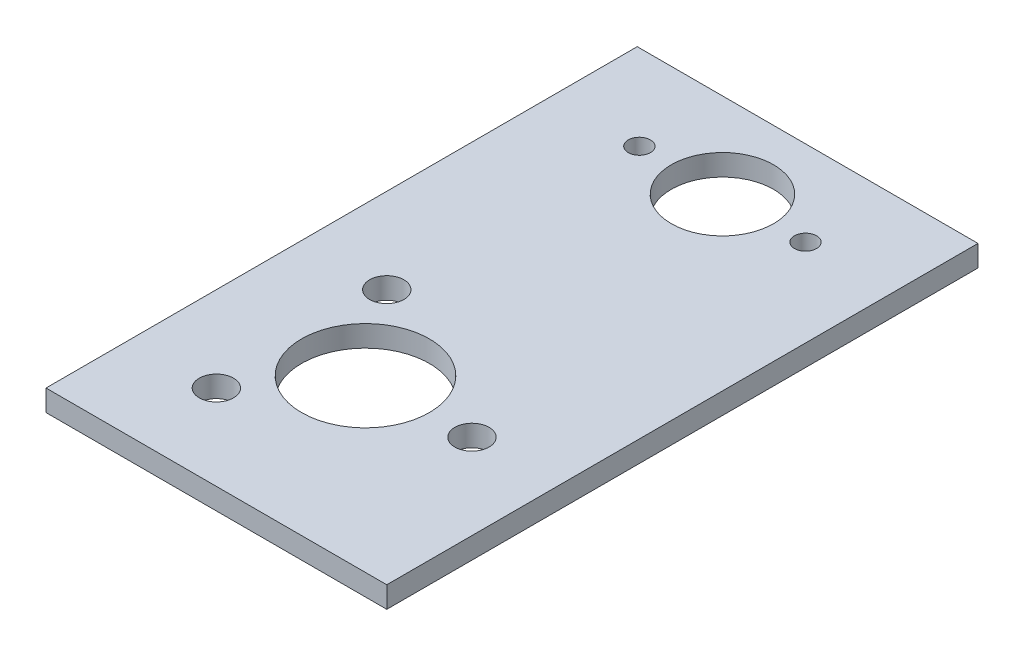
ISO-10303-21;
HEADER;
FILE_DESCRIPTION(('STEP AP214'),'2;1');
FILE_NAME('part.step','',(''),(''),'','','');
FILE_SCHEMA(('AUTOMOTIVE_DESIGN { 1 0 10303 214 1 1 1 1 }'));
ENDSEC;
DATA;
#1=APPLICATION_CONTEXT('core data for automotive mechanical design processes');
#2=APPLICATION_PROTOCOL_DEFINITION('international standard','automotive_design',2000,#1);
#3=PRODUCT_CONTEXT('',#1,'mechanical');
#4=PRODUCT('Part','Part','',(#3));
#5=PRODUCT_RELATED_PRODUCT_CATEGORY('part','',(#4));
#6=PRODUCT_DEFINITION_FORMATION('','',#4);
#7=PRODUCT_DEFINITION_CONTEXT('part definition',#1,'design');
#8=PRODUCT_DEFINITION('design','',#6,#7);
#9=PRODUCT_DEFINITION_SHAPE('','',#8);
#10=(LENGTH_UNIT() NAMED_UNIT(*) SI_UNIT(.MILLI.,.METRE.));
#11=(NAMED_UNIT(*) PLANE_ANGLE_UNIT() SI_UNIT($,.RADIAN.));
#12=(NAMED_UNIT(*) SI_UNIT($,.STERADIAN.) SOLID_ANGLE_UNIT());
#13=UNCERTAINTY_MEASURE_WITH_UNIT(LENGTH_MEASURE(1.E-05),#10,'distance_accuracy_value','');
#14=(GEOMETRIC_REPRESENTATION_CONTEXT(3) GLOBAL_UNCERTAINTY_ASSIGNED_CONTEXT((#13)) GLOBAL_UNIT_ASSIGNED_CONTEXT((#10,
#11,#12)) REPRESENTATION_CONTEXT('',''));
#15=CARTESIAN_POINT('',(0.,0.,0.));
#16=DIRECTION('',(0.,0.,1.));
#17=DIRECTION('',(1.,0.,0.));
#18=AXIS2_PLACEMENT_3D('',#15,#16,#17);
#19=CARTESIAN_POINT('',(0.,3.175,0.));
#20=DIRECTION('',(0.,0.,-1.));
#21=DIRECTION('',(-1.,0.,0.));
#22=AXIS2_PLACEMENT_3D('',#19,#20,#21);
#23=PLANE('',#22);
#24=DIRECTION('',(1.,0.,0.));
#25=VECTOR('',#24,1.);
#26=CARTESIAN_POINT('',(0.,0.,0.));
#27=LINE('',#26,#25);
#28=CARTESIAN_POINT('',(0.,0.,0.));
#29=VERTEX_POINT('',#28);
#30=CARTESIAN_POINT('',(50.8,0.,0.));
#31=VERTEX_POINT('',#30);
#32=EDGE_CURVE('E96',#29,#31,#27,.T.);
#33=ORIENTED_EDGE('',*,*,#32,.T.);
#34=DIRECTION('',(0.,-1.,0.));
#35=VECTOR('',#34,1.);
#36=CARTESIAN_POINT('',(50.8,3.175,0.));
#37=LINE('',#36,#35);
#38=CARTESIAN_POINT('',(50.8,3.175,0.));
#39=VERTEX_POINT('',#38);
#40=EDGE_CURVE('E11',#39,#31,#37,.T.);
#41=ORIENTED_EDGE('',*,*,#40,.F.);
#42=DIRECTION('',(1.,0.,0.));
#43=VECTOR('',#42,1.);
#44=CARTESIAN_POINT('',(0.,3.175,0.));
#45=LINE('',#44,#43);
#46=CARTESIAN_POINT('',(0.,3.175,0.));
#47=VERTEX_POINT('',#46);
#48=EDGE_CURVE('E82',#47,#39,#45,.T.);
#49=ORIENTED_EDGE('',*,*,#48,.F.);
#50=DIRECTION('',(0.,-1.,0.));
#51=VECTOR('',#50,1.);
#52=CARTESIAN_POINT('',(0.,3.175,0.));
#53=LINE('',#52,#51);
#54=EDGE_CURVE('E49',#47,#29,#53,.T.);
#55=ORIENTED_EDGE('',*,*,#54,.T.);
#56=EDGE_LOOP('',(#33,#41,#49,#55));
#57=FACE_BOUND('',#56,.T.);
#58=ADVANCED_FACE('F33',(#57),#23,.F.);
#59=CARTESIAN_POINT('',(50.8,3.175,0.));
#60=DIRECTION('',(-1.,0.,0.));
#61=DIRECTION('',(0.,0.,1.));
#62=AXIS2_PLACEMENT_3D('',#59,#60,#61);
#63=PLANE('',#62);
#64=DIRECTION('',(0.,0.,-1.));
#65=VECTOR('',#64,1.);
#66=CARTESIAN_POINT('',(50.8,0.,0.));
#67=LINE('',#66,#65);
#68=CARTESIAN_POINT('',(50.8,0.,-88.138));
#69=VERTEX_POINT('',#68);
#70=EDGE_CURVE('E87',#31,#69,#67,.T.);
#71=ORIENTED_EDGE('',*,*,#70,.T.);
#72=DIRECTION('',(0.,-1.,0.));
#73=VECTOR('',#72,1.);
#74=CARTESIAN_POINT('',(50.8,3.175,-88.138));
#75=LINE('',#74,#73);
#76=CARTESIAN_POINT('',(50.8,3.175,-88.138));
#77=VERTEX_POINT('',#76);
#78=EDGE_CURVE('E41',#77,#69,#75,.T.);
#79=ORIENTED_EDGE('',*,*,#78,.F.);
#80=DIRECTION('',(0.,0.,-1.));
#81=VECTOR('',#80,1.);
#82=CARTESIAN_POINT('',(50.8,3.175,0.));
#83=LINE('',#82,#81);
#84=EDGE_CURVE('E74',#39,#77,#83,.T.);
#85=ORIENTED_EDGE('',*,*,#84,.F.);
#86=ORIENTED_EDGE('',*,*,#40,.T.);
#87=EDGE_LOOP('',(#71,#79,#85,#86));
#88=FACE_BOUND('',#87,.T.);
#89=ADVANCED_FACE('F86',(#88),#63,.F.);
#90=CARTESIAN_POINT('',(0.,3.175,-88.138));
#91=DIRECTION('',(0.,0.,-1.));
#92=DIRECTION('',(-1.,0.,0.));
#93=AXIS2_PLACEMENT_3D('',#90,#91,#92);
#94=PLANE('',#93);
#95=DIRECTION('',(1.,0.,0.));
#96=VECTOR('',#95,1.);
#97=CARTESIAN_POINT('',(0.,0.,-88.138));
#98=LINE('',#97,#96);
#99=CARTESIAN_POINT('',(0.,0.,-88.138));
#100=VERTEX_POINT('',#99);
#101=EDGE_CURVE('E100',#100,#69,#98,.T.);
#102=ORIENTED_EDGE('',*,*,#101,.F.);
#103=DIRECTION('',(0.,-1.,0.));
#104=VECTOR('',#103,1.);
#105=CARTESIAN_POINT('',(0.,3.175,-88.138));
#106=LINE('',#105,#104);
#107=CARTESIAN_POINT('',(0.,3.175,-88.138));
#108=VERTEX_POINT('',#107);
#109=EDGE_CURVE('E63',#108,#100,#106,.T.);
#110=ORIENTED_EDGE('',*,*,#109,.F.);
#111=DIRECTION('',(1.,0.,0.));
#112=VECTOR('',#111,1.);
#113=CARTESIAN_POINT('',(0.,3.175,-88.138));
#114=LINE('',#113,#112);
#115=EDGE_CURVE('E81',#108,#77,#114,.T.);
#116=ORIENTED_EDGE('',*,*,#115,.T.);
#117=ORIENTED_EDGE('',*,*,#78,.T.);
#118=EDGE_LOOP('',(#102,#110,#116,#117));
#119=FACE_BOUND('',#118,.T.);
#120=ADVANCED_FACE('F90',(#119),#94,.T.);
#121=CARTESIAN_POINT('',(0.,3.175,0.));
#122=DIRECTION('',(-1.,0.,0.));
#123=DIRECTION('',(0.,0.,1.));
#124=AXIS2_PLACEMENT_3D('',#121,#122,#123);
#125=PLANE('',#124);
#126=DIRECTION('',(0.,0.,-1.));
#127=VECTOR('',#126,1.);
#128=CARTESIAN_POINT('',(0.,0.,0.));
#129=LINE('',#128,#127);
#130=EDGE_CURVE('E102',#29,#100,#129,.T.);
#131=ORIENTED_EDGE('',*,*,#130,.F.);
#132=ORIENTED_EDGE('',*,*,#54,.F.);
#133=DIRECTION('',(0.,0.,-1.));
#134=VECTOR('',#133,1.);
#135=CARTESIAN_POINT('',(0.,3.175,0.));
#136=LINE('',#135,#134);
#137=EDGE_CURVE('E91',#47,#108,#136,.T.);
#138=ORIENTED_EDGE('',*,*,#137,.T.);
#139=ORIENTED_EDGE('',*,*,#109,.T.);
#140=EDGE_LOOP('',(#131,#132,#138,#139));
#141=FACE_BOUND('',#140,.T.);
#142=ADVANCED_FACE('F162',(#141),#125,.T.);
#143=CARTESIAN_POINT('',(0.,3.175,0.));
#144=DIRECTION('',(0.,1.,0.));
#145=DIRECTION('',(0.,0.,1.));
#146=AXIS2_PLACEMENT_3D('',#143,#144,#145);
#147=PLANE('',#146);
#148=CARTESIAN_POINT('',(25.4,3.175,-75.438));
#149=DIRECTION('',(0.,1.,0.));
#150=DIRECTION('',(0.,0.,1.));
#151=AXIS2_PLACEMENT_3D('',#148,#149,#150);
#152=CIRCLE('',#151,7.61999999999998);
#153=CARTESIAN_POINT('',(25.4,3.175,-67.818));
#154=VERTEX_POINT('',#153);
#155=EDGE_CURVE('E144',#154,#154,#152,.T.);
#156=ORIENTED_EDGE('',*,*,#155,.F.);
#157=EDGE_LOOP('',(#156));
#158=FACE_BOUND('',#157,.T.);
#159=CARTESIAN_POINT('',(37.7825,3.175,-75.438));
#160=DIRECTION('',(0.,1.,0.));
#161=DIRECTION('',(0.,0.,1.));
#162=AXIS2_PLACEMENT_3D('',#159,#160,#161);
#163=CIRCLE('',#162,1.651);
#164=CARTESIAN_POINT('',(37.7825,3.175,-73.787));
#165=VERTEX_POINT('',#164);
#166=EDGE_CURVE('E138',#165,#165,#163,.T.);
#167=ORIENTED_EDGE('',*,*,#166,.F.);
#168=EDGE_LOOP('',(#167));
#169=FACE_BOUND('',#168,.T.);
#170=CARTESIAN_POINT('',(13.0175,3.175,-75.438));
#171=DIRECTION('',(0.,1.,0.));
#172=DIRECTION('',(0.,0.,1.));
#173=AXIS2_PLACEMENT_3D('',#170,#171,#172);
#174=CIRCLE('',#173,1.65099999999999);
#175=CARTESIAN_POINT('',(13.0175,3.175,-73.787));
#176=VERTEX_POINT('',#175);
#177=EDGE_CURVE('E132',#176,#176,#174,.T.);
#178=ORIENTED_EDGE('',*,*,#177,.F.);
#179=EDGE_LOOP('',(#178));
#180=FACE_BOUND('',#179,.T.);
#181=CARTESIAN_POINT('',(22.225,3.175,-25.4));
#182=DIRECTION('',(0.,1.,0.));
#183=DIRECTION('',(0.,0.,1.));
#184=AXIS2_PLACEMENT_3D('',#181,#182,#183);
#185=CIRCLE('',#184,9.52500000000001);
#186=CARTESIAN_POINT('',(22.225,3.175,-15.875));
#187=VERTEX_POINT('',#186);
#188=EDGE_CURVE('E126',#187,#187,#185,.T.);
#189=ORIENTED_EDGE('',*,*,#188,.F.);
#190=EDGE_LOOP('',(#189));
#191=FACE_BOUND('',#190,.T.);
#192=CARTESIAN_POINT('',(38.1,3.175,-25.4));
#193=DIRECTION('',(0.,1.,0.));
#194=DIRECTION('',(0.,0.,1.));
#195=AXIS2_PLACEMENT_3D('',#192,#193,#194);
#196=CIRCLE('',#195,2.5527);
#197=CARTESIAN_POINT('',(38.1,3.175,-22.8473));
#198=VERTEX_POINT('',#197);
#199=EDGE_CURVE('E120',#198,#198,#196,.T.);
#200=ORIENTED_EDGE('',*,*,#199,.F.);
#201=EDGE_LOOP('',(#200));
#202=FACE_BOUND('',#201,.T.);
#203=CARTESIAN_POINT('',(12.7,3.175,-38.1));
#204=DIRECTION('',(0.,1.,0.));
#205=DIRECTION('',(0.,0.,1.));
#206=AXIS2_PLACEMENT_3D('',#203,#204,#205);
#207=CIRCLE('',#206,2.5527);
#208=CARTESIAN_POINT('',(12.7,3.175,-35.5473));
#209=VERTEX_POINT('',#208);
#210=EDGE_CURVE('E114',#209,#209,#207,.T.);
#211=ORIENTED_EDGE('',*,*,#210,.F.);
#212=EDGE_LOOP('',(#211));
#213=FACE_BOUND('',#212,.T.);
#214=CARTESIAN_POINT('',(12.7,3.175,-12.7));
#215=DIRECTION('',(0.,1.,0.));
#216=DIRECTION('',(0.,0.,1.));
#217=AXIS2_PLACEMENT_3D('',#214,#215,#216);
#218=CIRCLE('',#217,2.5527);
#219=CARTESIAN_POINT('',(12.7,3.175,-10.1473));
#220=VERTEX_POINT('',#219);
#221=EDGE_CURVE('E108',#220,#220,#218,.T.);
#222=ORIENTED_EDGE('',*,*,#221,.F.);
#223=EDGE_LOOP('',(#222));
#224=FACE_BOUND('',#223,.T.);
#225=ORIENTED_EDGE('',*,*,#48,.T.);
#226=ORIENTED_EDGE('',*,*,#84,.T.);
#227=ORIENTED_EDGE('',*,*,#115,.F.);
#228=ORIENTED_EDGE('',*,*,#137,.F.);
#229=EDGE_LOOP('',(#225,#226,#227,#228));
#230=FACE_BOUND('',#229,.T.);
#231=ADVANCED_FACE('F78',(#158,#169,#180,#191,#202,#213,#224,#230),#147,.T.);
#232=CARTESIAN_POINT('',(0.,0.,0.));
#233=DIRECTION('',(0.,1.,0.));
#234=DIRECTION('',(0.,0.,1.));
#235=AXIS2_PLACEMENT_3D('',#232,#233,#234);
#236=PLANE('',#235);
#237=CARTESIAN_POINT('',(25.4,0.,-75.438));
#238=DIRECTION('',(0.,1.,0.));
#239=DIRECTION('',(0.,0.,1.));
#240=AXIS2_PLACEMENT_3D('',#237,#238,#239);
#241=CIRCLE('',#240,7.61999999999998);
#242=CARTESIAN_POINT('',(25.4,0.,-67.818));
#243=VERTEX_POINT('',#242);
#244=EDGE_CURVE('E141',#243,#243,#241,.T.);
#245=ORIENTED_EDGE('',*,*,#244,.T.);
#246=EDGE_LOOP('',(#245));
#247=FACE_BOUND('',#246,.T.);
#248=CARTESIAN_POINT('',(37.7825,0.,-75.438));
#249=DIRECTION('',(0.,1.,0.));
#250=DIRECTION('',(0.,0.,1.));
#251=AXIS2_PLACEMENT_3D('',#248,#249,#250);
#252=CIRCLE('',#251,1.651);
#253=CARTESIAN_POINT('',(37.7825,0.,-73.787));
#254=VERTEX_POINT('',#253);
#255=EDGE_CURVE('E135',#254,#254,#252,.T.);
#256=ORIENTED_EDGE('',*,*,#255,.T.);
#257=EDGE_LOOP('',(#256));
#258=FACE_BOUND('',#257,.T.);
#259=CARTESIAN_POINT('',(13.0175,0.,-75.438));
#260=DIRECTION('',(0.,1.,0.));
#261=DIRECTION('',(0.,0.,1.));
#262=AXIS2_PLACEMENT_3D('',#259,#260,#261);
#263=CIRCLE('',#262,1.65099999999999);
#264=CARTESIAN_POINT('',(13.0175,0.,-73.787));
#265=VERTEX_POINT('',#264);
#266=EDGE_CURVE('E129',#265,#265,#263,.T.);
#267=ORIENTED_EDGE('',*,*,#266,.T.);
#268=EDGE_LOOP('',(#267));
#269=FACE_BOUND('',#268,.T.);
#270=CARTESIAN_POINT('',(22.225,0.,-25.4));
#271=DIRECTION('',(0.,1.,0.));
#272=DIRECTION('',(0.,0.,1.));
#273=AXIS2_PLACEMENT_3D('',#270,#271,#272);
#274=CIRCLE('',#273,9.52500000000001);
#275=CARTESIAN_POINT('',(22.225,0.,-15.875));
#276=VERTEX_POINT('',#275);
#277=EDGE_CURVE('E123',#276,#276,#274,.T.);
#278=ORIENTED_EDGE('',*,*,#277,.T.);
#279=EDGE_LOOP('',(#278));
#280=FACE_BOUND('',#279,.T.);
#281=CARTESIAN_POINT('',(38.1,0.,-25.4));
#282=DIRECTION('',(0.,1.,0.));
#283=DIRECTION('',(0.,0.,1.));
#284=AXIS2_PLACEMENT_3D('',#281,#282,#283);
#285=CIRCLE('',#284,2.5527);
#286=CARTESIAN_POINT('',(38.1,0.,-22.8473));
#287=VERTEX_POINT('',#286);
#288=EDGE_CURVE('E117',#287,#287,#285,.T.);
#289=ORIENTED_EDGE('',*,*,#288,.T.);
#290=EDGE_LOOP('',(#289));
#291=FACE_BOUND('',#290,.T.);
#292=CARTESIAN_POINT('',(12.7,0.,-38.1));
#293=DIRECTION('',(0.,1.,0.));
#294=DIRECTION('',(0.,0.,1.));
#295=AXIS2_PLACEMENT_3D('',#292,#293,#294);
#296=CIRCLE('',#295,2.5527);
#297=CARTESIAN_POINT('',(12.7,0.,-35.5473));
#298=VERTEX_POINT('',#297);
#299=EDGE_CURVE('E111',#298,#298,#296,.T.);
#300=ORIENTED_EDGE('',*,*,#299,.T.);
#301=EDGE_LOOP('',(#300));
#302=FACE_BOUND('',#301,.T.);
#303=CARTESIAN_POINT('',(12.7,0.,-12.7));
#304=DIRECTION('',(0.,1.,0.));
#305=DIRECTION('',(0.,0.,1.));
#306=AXIS2_PLACEMENT_3D('',#303,#304,#305);
#307=CIRCLE('',#306,2.5527);
#308=CARTESIAN_POINT('',(12.7,0.,-10.1473));
#309=VERTEX_POINT('',#308);
#310=EDGE_CURVE('E98',#309,#309,#307,.T.);
#311=ORIENTED_EDGE('',*,*,#310,.T.);
#312=EDGE_LOOP('',(#311));
#313=FACE_BOUND('',#312,.T.);
#314=ORIENTED_EDGE('',*,*,#32,.F.);
#315=ORIENTED_EDGE('',*,*,#130,.T.);
#316=ORIENTED_EDGE('',*,*,#101,.T.);
#317=ORIENTED_EDGE('',*,*,#70,.F.);
#318=EDGE_LOOP('',(#314,#315,#316,#317));
#319=FACE_BOUND('',#318,.T.);
#320=ADVANCED_FACE('F150',(#247,#258,#269,#280,#291,#302,#313,#319),#236,.F.);
#321=CARTESIAN_POINT('',(12.7,0.,-12.7));
#322=DIRECTION('',(0.,1.,0.));
#323=DIRECTION('',(0.,0.,1.));
#324=AXIS2_PLACEMENT_3D('',#321,#322,#323);
#325=CYLINDRICAL_SURFACE('',#324,2.5527);
#326=ORIENTED_EDGE('',*,*,#310,.F.);
#327=EDGE_LOOP('',(#326));
#328=FACE_BOUND('',#327,.T.);
#329=ORIENTED_EDGE('',*,*,#221,.T.);
#330=EDGE_LOOP('',(#329));
#331=FACE_BOUND('',#330,.T.);
#332=ADVANCED_FACE('F176',(#328,#331),#325,.F.);
#333=CARTESIAN_POINT('',(12.7,0.,-38.1));
#334=DIRECTION('',(0.,1.,0.));
#335=DIRECTION('',(0.,0.,1.));
#336=AXIS2_PLACEMENT_3D('',#333,#334,#335);
#337=CYLINDRICAL_SURFACE('',#336,2.5527);
#338=ORIENTED_EDGE('',*,*,#299,.F.);
#339=EDGE_LOOP('',(#338));
#340=FACE_BOUND('',#339,.T.);
#341=ORIENTED_EDGE('',*,*,#210,.T.);
#342=EDGE_LOOP('',(#341));
#343=FACE_BOUND('',#342,.T.);
#344=ADVANCED_FACE('F178',(#340,#343),#337,.F.);
#345=CARTESIAN_POINT('',(38.1,0.,-25.4));
#346=DIRECTION('',(0.,1.,0.));
#347=DIRECTION('',(0.,0.,1.));
#348=AXIS2_PLACEMENT_3D('',#345,#346,#347);
#349=CYLINDRICAL_SURFACE('',#348,2.5527);
#350=ORIENTED_EDGE('',*,*,#288,.F.);
#351=EDGE_LOOP('',(#350));
#352=FACE_BOUND('',#351,.T.);
#353=ORIENTED_EDGE('',*,*,#199,.T.);
#354=EDGE_LOOP('',(#353));
#355=FACE_BOUND('',#354,.T.);
#356=ADVANCED_FACE('F185',(#352,#355),#349,.F.);
#357=CARTESIAN_POINT('',(22.225,0.,-25.4));
#358=DIRECTION('',(0.,1.,0.));
#359=DIRECTION('',(0.,0.,1.));
#360=AXIS2_PLACEMENT_3D('',#357,#358,#359);
#361=CYLINDRICAL_SURFACE('',#360,9.52500000000001);
#362=ORIENTED_EDGE('',*,*,#277,.F.);
#363=EDGE_LOOP('',(#362));
#364=FACE_BOUND('',#363,.T.);
#365=ORIENTED_EDGE('',*,*,#188,.T.);
#366=EDGE_LOOP('',(#365));
#367=FACE_BOUND('',#366,.T.);
#368=ADVANCED_FACE('F247',(#364,#367),#361,.F.);
#369=CARTESIAN_POINT('',(13.0175,0.,-75.438));
#370=DIRECTION('',(0.,1.,0.));
#371=DIRECTION('',(0.,0.,1.));
#372=AXIS2_PLACEMENT_3D('',#369,#370,#371);
#373=CYLINDRICAL_SURFACE('',#372,1.65099999999999);
#374=ORIENTED_EDGE('',*,*,#266,.F.);
#375=EDGE_LOOP('',(#374));
#376=FACE_BOUND('',#375,.T.);
#377=ORIENTED_EDGE('',*,*,#177,.T.);
#378=EDGE_LOOP('',(#377));
#379=FACE_BOUND('',#378,.T.);
#380=ADVANCED_FACE('F255',(#376,#379),#373,.F.);
#381=CARTESIAN_POINT('',(37.7825,0.,-75.438));
#382=DIRECTION('',(0.,1.,0.));
#383=DIRECTION('',(0.,0.,1.));
#384=AXIS2_PLACEMENT_3D('',#381,#382,#383);
#385=CYLINDRICAL_SURFACE('',#384,1.651);
#386=ORIENTED_EDGE('',*,*,#255,.F.);
#387=EDGE_LOOP('',(#386));
#388=FACE_BOUND('',#387,.T.);
#389=ORIENTED_EDGE('',*,*,#166,.T.);
#390=EDGE_LOOP('',(#389));
#391=FACE_BOUND('',#390,.T.);
#392=ADVANCED_FACE('F156',(#388,#391),#385,.F.);
#393=CARTESIAN_POINT('',(25.4,0.,-75.438));
#394=DIRECTION('',(0.,1.,0.));
#395=DIRECTION('',(0.,0.,1.));
#396=AXIS2_PLACEMENT_3D('',#393,#394,#395);
#397=CYLINDRICAL_SURFACE('',#396,7.61999999999998);
#398=ORIENTED_EDGE('',*,*,#244,.F.);
#399=EDGE_LOOP('',(#398));
#400=FACE_BOUND('',#399,.T.);
#401=ORIENTED_EDGE('',*,*,#155,.T.);
#402=EDGE_LOOP('',(#401));
#403=FACE_BOUND('',#402,.T.);
#404=ADVANCED_FACE('F153',(#400,#403),#397,.F.);
#405=CLOSED_SHELL('',(#58,#89,#120,#142,#231,#320,#332,#344,#356,#368,#380,#392,#404));
#406=MANIFOLD_SOLID_BREP('B2',#405);
#407=ADVANCED_BREP_SHAPE_REPRESENTATION('',(#18,#406),#14);
#408=SHAPE_DEFINITION_REPRESENTATION(#9,#407);
ENDSEC;
END-ISO-10303-21;
